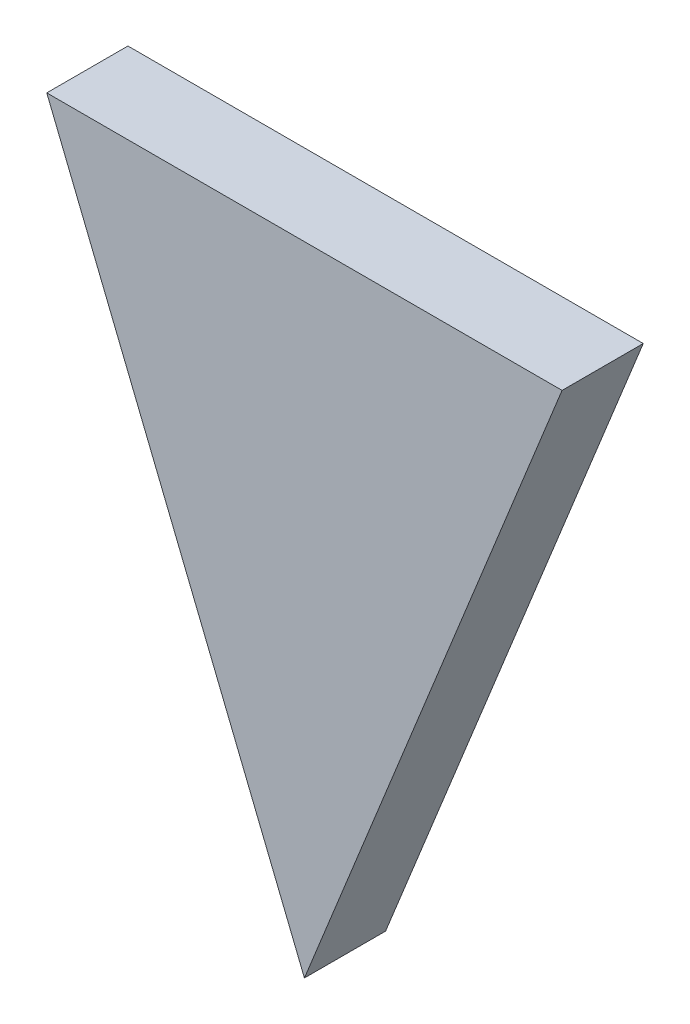
ISO-10303-21;
HEADER;
FILE_DESCRIPTION(('STEP AP214'),'2;1');
FILE_NAME('part.step','',(''),(''),'','','');
FILE_SCHEMA(('AUTOMOTIVE_DESIGN { 1 0 10303 214 1 1 1 1 }'));
ENDSEC;
DATA;
#1=APPLICATION_CONTEXT('core data for automotive mechanical design processes');
#2=APPLICATION_PROTOCOL_DEFINITION('international standard','automotive_design',2000,#1);
#3=PRODUCT_CONTEXT('',#1,'mechanical');
#4=PRODUCT('Part','Part','',(#3));
#5=PRODUCT_RELATED_PRODUCT_CATEGORY('part','',(#4));
#6=PRODUCT_DEFINITION_FORMATION('','',#4);
#7=PRODUCT_DEFINITION_CONTEXT('part definition',#1,'design');
#8=PRODUCT_DEFINITION('design','',#6,#7);
#9=PRODUCT_DEFINITION_SHAPE('','',#8);
#10=(LENGTH_UNIT() NAMED_UNIT(*) SI_UNIT(.MILLI.,.METRE.));
#11=(NAMED_UNIT(*) PLANE_ANGLE_UNIT() SI_UNIT($,.RADIAN.));
#12=(NAMED_UNIT(*) SI_UNIT($,.STERADIAN.) SOLID_ANGLE_UNIT());
#13=UNCERTAINTY_MEASURE_WITH_UNIT(LENGTH_MEASURE(1.E-05),#10,'distance_accuracy_value','');
#14=(GEOMETRIC_REPRESENTATION_CONTEXT(3) GLOBAL_UNCERTAINTY_ASSIGNED_CONTEXT((#13)) GLOBAL_UNIT_ASSIGNED_CONTEXT((#10,
#11,#12)) REPRESENTATION_CONTEXT('',''));
#15=CARTESIAN_POINT('',(0.,0.,0.));
#16=DIRECTION('',(0.,0.,1.));
#17=DIRECTION('',(1.,0.,0.));
#18=AXIS2_PLACEMENT_3D('',#15,#16,#17);
#19=CARTESIAN_POINT('',(0.198711252305921,-0.467683125106459,0.));
#20=DIRECTION('',(0.,1.,0.));
#21=DIRECTION('',(-1.,0.,0.));
#22=AXIS2_PLACEMENT_3D('',#19,#20,#21);
#23=PLANE('',#22);
#24=DIRECTION('',(-1.,0.,0.));
#25=VECTOR('',#24,1.);
#26=CARTESIAN_POINT('',(0.198711252305921,-0.467683125106459,0.));
#27=LINE('',#26,#25);
#28=CARTESIAN_POINT('',(0.198711252305921,-0.467683125106459,0.));
#29=VERTEX_POINT('',#28);
#30=CARTESIAN_POINT('',(0.179664935076851,-0.467683125106459,0.));
#31=VERTEX_POINT('',#30);
#32=EDGE_CURVE('E11',#29,#31,#27,.T.);
#33=ORIENTED_EDGE('',*,*,#32,.T.);
#34=DIRECTION('',(0.,0.,1.));
#35=VECTOR('',#34,1.);
#36=CARTESIAN_POINT('',(0.179664935076851,-0.467683125106459,0.));
#37=LINE('',#36,#35);
#38=CARTESIAN_POINT('',(0.179664935076851,-0.467683125106459,0.003));
#39=VERTEX_POINT('',#38);
#40=EDGE_CURVE('E24',#31,#39,#37,.T.);
#41=ORIENTED_EDGE('',*,*,#40,.T.);
#42=DIRECTION('',(-1.,0.,0.));
#43=VECTOR('',#42,1.);
#44=CARTESIAN_POINT('',(0.198711252305921,-0.467683125106459,0.003));
#45=LINE('',#44,#43);
#46=CARTESIAN_POINT('',(0.198711252305921,-0.467683125106459,0.003));
#47=VERTEX_POINT('',#46);
#48=EDGE_CURVE('E67',#47,#39,#45,.T.);
#49=ORIENTED_EDGE('',*,*,#48,.F.);
#50=DIRECTION('',(0.,0.,1.));
#51=VECTOR('',#50,1.);
#52=CARTESIAN_POINT('',(0.198711252305921,-0.467683125106459,0.));
#53=LINE('',#52,#51);
#54=EDGE_CURVE('E54',#29,#47,#53,.T.);
#55=ORIENTED_EDGE('',*,*,#54,.F.);
#56=EDGE_LOOP('',(#33,#41,#49,#55));
#57=FACE_BOUND('',#56,.T.);
#58=ADVANCED_FACE('F17',(#57),#23,.T.);
#59=CARTESIAN_POINT('',(0.189188093691386,-0.491253769796349,0.));
#60=DIRECTION('',(0.927183854567099,-0.37460659341514,0.));
#61=DIRECTION('',(0.37460659341514,0.927183854567099,0.));
#62=AXIS2_PLACEMENT_3D('',#59,#60,#61);
#63=PLANE('',#62);
#64=DIRECTION('',(0.37460659341514,0.927183854567099,0.));
#65=VECTOR('',#64,1.);
#66=CARTESIAN_POINT('',(0.189188093691386,-0.491253769796349,0.));
#67=LINE('',#66,#65);
#68=CARTESIAN_POINT('',(0.189188093691386,-0.491253769796349,0.));
#69=VERTEX_POINT('',#68);
#70=EDGE_CURVE('E58',#69,#29,#67,.T.);
#71=ORIENTED_EDGE('',*,*,#70,.T.);
#72=ORIENTED_EDGE('',*,*,#54,.T.);
#73=DIRECTION('',(0.37460659341514,0.927183854567099,0.));
#74=VECTOR('',#73,1.);
#75=CARTESIAN_POINT('',(0.189188093691386,-0.491253769796349,0.003));
#76=LINE('',#75,#74);
#77=CARTESIAN_POINT('',(0.189188093691386,-0.491253769796349,0.003));
#78=VERTEX_POINT('',#77);
#79=EDGE_CURVE('E48',#78,#47,#76,.T.);
#80=ORIENTED_EDGE('',*,*,#79,.F.);
#81=DIRECTION('',(0.,0.,1.));
#82=VECTOR('',#81,1.);
#83=CARTESIAN_POINT('',(0.189188093691386,-0.491253769796349,0.));
#84=LINE('',#83,#82);
#85=EDGE_CURVE('E52',#69,#78,#84,.T.);
#86=ORIENTED_EDGE('',*,*,#85,.F.);
#87=EDGE_LOOP('',(#71,#72,#80,#86));
#88=FACE_BOUND('',#87,.T.);
#89=ADVANCED_FACE('F51',(#88),#63,.T.);
#90=CARTESIAN_POINT('',(0.179664935076851,-0.467683125106459,0.));
#91=DIRECTION('',(-0.927183854567098,-0.374606593415143,0.));
#92=DIRECTION('',(0.374606593415143,-0.927183854567098,0.));
#93=AXIS2_PLACEMENT_3D('',#90,#91,#92);
#94=PLANE('',#93);
#95=DIRECTION('',(0.374606593415143,-0.927183854567098,0.));
#96=VECTOR('',#95,1.);
#97=CARTESIAN_POINT('',(0.179664935076851,-0.467683125106459,0.));
#98=LINE('',#97,#96);
#99=EDGE_CURVE('E64',#31,#69,#98,.T.);
#100=ORIENTED_EDGE('',*,*,#99,.T.);
#101=ORIENTED_EDGE('',*,*,#85,.T.);
#102=DIRECTION('',(0.374606593415143,-0.927183854567098,0.));
#103=VECTOR('',#102,1.);
#104=CARTESIAN_POINT('',(0.179664935076851,-0.467683125106459,0.003));
#105=LINE('',#104,#103);
#106=EDGE_CURVE('E63',#39,#78,#105,.T.);
#107=ORIENTED_EDGE('',*,*,#106,.F.);
#108=ORIENTED_EDGE('',*,*,#40,.F.);
#109=EDGE_LOOP('',(#100,#101,#107,#108));
#110=FACE_BOUND('',#109,.T.);
#111=ADVANCED_FACE('F62',(#110),#94,.T.);
#112=CARTESIAN_POINT('',(0.189188093691386,-0.479468447451404,0.003));
#113=DIRECTION('',(0.,0.,1.));
#114=DIRECTION('',(1.,0.,0.));
#115=AXIS2_PLACEMENT_3D('',#112,#113,#114);
#116=PLANE('',#115);
#117=ORIENTED_EDGE('',*,*,#106,.T.);
#118=ORIENTED_EDGE('',*,*,#79,.T.);
#119=ORIENTED_EDGE('',*,*,#48,.T.);
#120=EDGE_LOOP('',(#117,#118,#119));
#121=FACE_BOUND('',#120,.T.);
#122=ADVANCED_FACE('F66',(#121),#116,.T.);
#123=CARTESIAN_POINT('',(0.189188093691386,-0.479468447451404,0.));
#124=DIRECTION('',(0.,0.,1.));
#125=DIRECTION('',(1.,0.,0.));
#126=AXIS2_PLACEMENT_3D('',#123,#124,#125);
#127=PLANE('',#126);
#128=ORIENTED_EDGE('',*,*,#99,.F.);
#129=ORIENTED_EDGE('',*,*,#32,.F.);
#130=ORIENTED_EDGE('',*,*,#70,.F.);
#131=EDGE_LOOP('',(#128,#129,#130));
#132=FACE_BOUND('',#131,.T.);
#133=ADVANCED_FACE('F73',(#132),#127,.F.);
#134=CLOSED_SHELL('',(#58,#89,#111,#122,#133));
#135=MANIFOLD_SOLID_BREP('B1',#134);
#136=ADVANCED_BREP_SHAPE_REPRESENTATION('',(#18,#135),#14);
#137=SHAPE_DEFINITION_REPRESENTATION(#9,#136);
ENDSEC;
END-ISO-10303-21;
